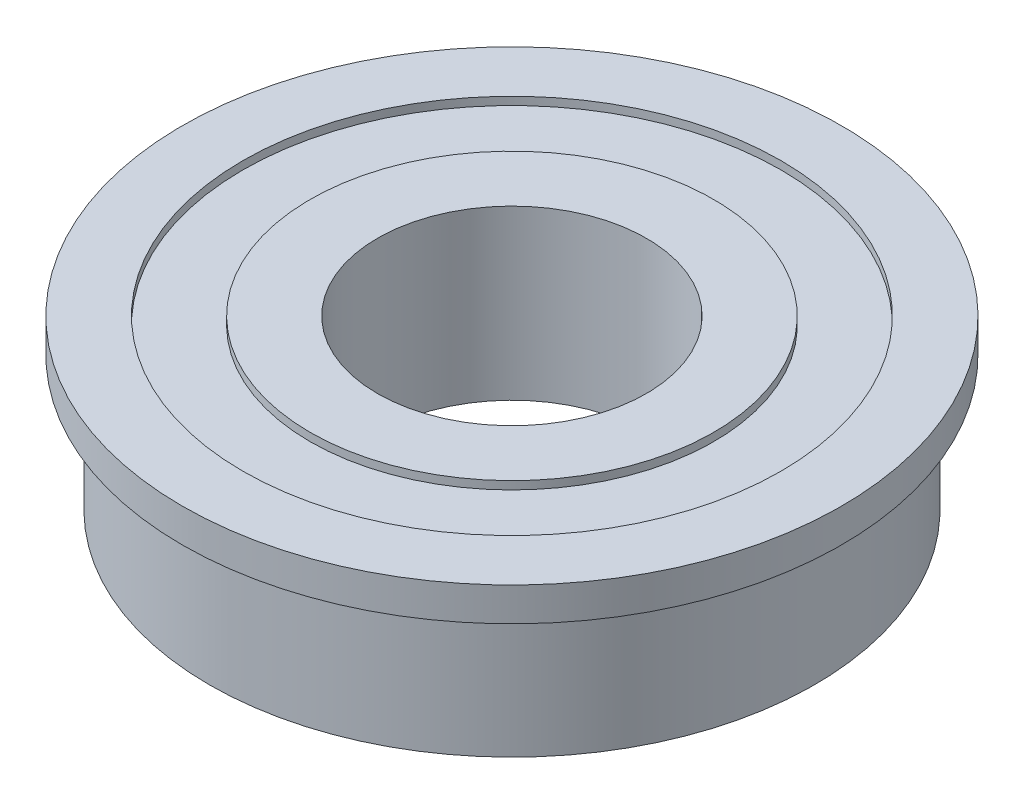
ISO-10303-21;
HEADER;
FILE_DESCRIPTION(('STEP AP214'),'2;1');
FILE_NAME('part.step','',(''),(''),'','','');
FILE_SCHEMA(('AUTOMOTIVE_DESIGN { 1 0 10303 214 1 1 1 1 }'));
ENDSEC;
DATA;
#1=APPLICATION_CONTEXT('core data for automotive mechanical design processes');
#2=APPLICATION_PROTOCOL_DEFINITION('international standard','automotive_design',2000,#1);
#3=PRODUCT_CONTEXT('',#1,'mechanical');
#4=PRODUCT('Part','Part','',(#3));
#5=PRODUCT_RELATED_PRODUCT_CATEGORY('part','',(#4));
#6=PRODUCT_DEFINITION_FORMATION('','',#4);
#7=PRODUCT_DEFINITION_CONTEXT('part definition',#1,'design');
#8=PRODUCT_DEFINITION('design','',#6,#7);
#9=PRODUCT_DEFINITION_SHAPE('','',#8);
#10=(LENGTH_UNIT() NAMED_UNIT(*) SI_UNIT(.MILLI.,.METRE.));
#11=(NAMED_UNIT(*) PLANE_ANGLE_UNIT() SI_UNIT($,.RADIAN.));
#12=(NAMED_UNIT(*) SI_UNIT($,.STERADIAN.) SOLID_ANGLE_UNIT());
#13=UNCERTAINTY_MEASURE_WITH_UNIT(LENGTH_MEASURE(1.E-05),#10,'distance_accuracy_value','');
#14=(GEOMETRIC_REPRESENTATION_CONTEXT(3) GLOBAL_UNCERTAINTY_ASSIGNED_CONTEXT((#13)) GLOBAL_UNIT_ASSIGNED_CONTEXT((#10,
#11,#12)) REPRESENTATION_CONTEXT('',''));
#15=CARTESIAN_POINT('',(0.,0.,0.));
#16=DIRECTION('',(0.,0.,1.));
#17=DIRECTION('',(1.,0.,0.));
#18=AXIS2_PLACEMENT_3D('',#15,#16,#17);
#19=CARTESIAN_POINT('',(0.,0.,0.));
#20=DIRECTION('',(0.,1.,0.));
#21=DIRECTION('',(0.,0.,1.));
#22=AXIS2_PLACEMENT_3D('',#19,#20,#21);
#23=CYLINDRICAL_SURFACE('',#22,15.5575);
#24=CARTESIAN_POINT('',(0.,6.34999999963,0.));
#25=DIRECTION('',(0.,1.,0.));
#26=DIRECTION('',(0.,0.,1.));
#27=AXIS2_PLACEMENT_3D('',#24,#25,#26);
#28=CIRCLE('',#27,15.5575);
#29=CARTESIAN_POINT('',(0.,6.34999999963,15.5575));
#30=VERTEX_POINT('',#29);
#31=EDGE_CURVE('E94',#30,#30,#28,.F.);
#32=ORIENTED_EDGE('',*,*,#31,.F.);
#33=EDGE_LOOP('',(#32));
#34=FACE_BOUND('',#33,.T.);
#35=CARTESIAN_POINT('',(0.,7.9375,0.));
#36=DIRECTION('',(0.,1.,0.));
#37=DIRECTION('',(0.,0.,1.));
#38=AXIS2_PLACEMENT_3D('',#35,#36,#37);
#39=CIRCLE('',#38,15.5575);
#40=CARTESIAN_POINT('',(0.,7.9375,15.5575));
#41=VERTEX_POINT('',#40);
#42=EDGE_CURVE('E51',#41,#41,#39,.T.);
#43=ORIENTED_EDGE('',*,*,#42,.F.);
#44=EDGE_LOOP('',(#43));
#45=FACE_BOUND('',#44,.T.);
#46=ADVANCED_FACE('F17',(#34,#45),#23,.T.);
#47=CARTESIAN_POINT('',(12.7,7.9375,0.));
#48=DIRECTION('',(0.,1.,0.));
#49=DIRECTION('',(0.,0.,1.));
#50=AXIS2_PLACEMENT_3D('',#47,#48,#49);
#51=PLANE('',#50);
#52=CARTESIAN_POINT('',(0.,7.9375,0.));
#53=DIRECTION('',(0.,1.,0.));
#54=DIRECTION('',(0.,0.,1.));
#55=AXIS2_PLACEMENT_3D('',#52,#53,#54);
#56=CIRCLE('',#55,12.7);
#57=CARTESIAN_POINT('',(0.,7.9375,12.7));
#58=VERTEX_POINT('',#57);
#59=EDGE_CURVE('E42',#58,#58,#56,.F.);
#60=ORIENTED_EDGE('',*,*,#59,.T.);
#61=EDGE_LOOP('',(#60));
#62=FACE_BOUND('',#61,.T.);
#63=ORIENTED_EDGE('',*,*,#42,.T.);
#64=EDGE_LOOP('',(#63));
#65=FACE_BOUND('',#64,.T.);
#66=ADVANCED_FACE('F100',(#62,#65),#51,.T.);
#67=CARTESIAN_POINT('',(15.5575,6.35,0.));
#68=DIRECTION('',(0.,-1.,0.));
#69=DIRECTION('',(0.,0.,-1.));
#70=AXIS2_PLACEMENT_3D('',#67,#68,#69);
#71=PLANE('',#70);
#72=CARTESIAN_POINT('',(0.,6.35,0.));
#73=DIRECTION('',(0.,-1.,0.));
#74=DIRECTION('',(0.,0.,-1.));
#75=AXIS2_PLACEMENT_3D('',#72,#73,#74);
#76=CIRCLE('',#75,14.2875);
#77=CARTESIAN_POINT('',(0.,6.35,14.2875));
#78=VERTEX_POINT('',#77);
#79=CARTESIAN_POINT('',(0.,6.35,-14.2875));
#80=VERTEX_POINT('',#79);
#81=EDGE_CURVE('E37',#78,#80,#76,.F.);
#82=ORIENTED_EDGE('',*,*,#81,.T.);
#83=CARTESIAN_POINT('',(0.,6.35,0.));
#84=DIRECTION('',(0.,-1.,0.));
#85=DIRECTION('',(0.,0.,1.));
#86=AXIS2_PLACEMENT_3D('',#83,#84,#85);
#87=CIRCLE('',#86,14.2875);
#88=EDGE_CURVE('E34',#80,#78,#87,.F.);
#89=ORIENTED_EDGE('',*,*,#88,.T.);
#90=EDGE_LOOP('',(#82,#89));
#91=FACE_BOUND('',#90,.T.);
#92=ORIENTED_EDGE('',*,*,#31,.T.);
#93=EDGE_LOOP('',(#92));
#94=FACE_BOUND('',#93,.T.);
#95=ADVANCED_FACE('F39',(#91,#94),#71,.T.);
#96=CARTESIAN_POINT('',(0.,0.,0.));
#97=DIRECTION('',(0.,1.,0.));
#98=DIRECTION('',(0.,0.,1.));
#99=AXIS2_PLACEMENT_3D('',#96,#97,#98);
#100=CYLINDRICAL_SURFACE('',#99,12.7);
#101=ORIENTED_EDGE('',*,*,#59,.F.);
#102=EDGE_LOOP('',(#101));
#103=FACE_BOUND('',#102,.T.);
#104=CARTESIAN_POINT('',(0.,7.55650000088,0.));
#105=DIRECTION('',(0.,1.,0.));
#106=DIRECTION('',(0.,0.,1.));
#107=AXIS2_PLACEMENT_3D('',#104,#105,#106);
#108=CIRCLE('',#107,12.7);
#109=CARTESIAN_POINT('',(0.,7.55650000088,12.7));
#110=VERTEX_POINT('',#109);
#111=EDGE_CURVE('E48',#110,#110,#108,.T.);
#112=ORIENTED_EDGE('',*,*,#111,.F.);
#113=EDGE_LOOP('',(#112));
#114=FACE_BOUND('',#113,.T.);
#115=ADVANCED_FACE('F144',(#103,#114),#100,.F.);
#116=CARTESIAN_POINT('',(9.525,7.5565,0.));
#117=DIRECTION('',(0.,1.,0.));
#118=DIRECTION('',(0.,0.,1.));
#119=AXIS2_PLACEMENT_3D('',#116,#117,#118);
#120=PLANE('',#119);
#121=CARTESIAN_POINT('',(0.,7.55650000088,0.));
#122=DIRECTION('',(0.,1.,0.));
#123=DIRECTION('',(0.,0.,1.));
#124=AXIS2_PLACEMENT_3D('',#121,#122,#123);
#125=CIRCLE('',#124,9.525);
#126=CARTESIAN_POINT('',(0.,7.55650000088,9.525));
#127=VERTEX_POINT('',#126);
#128=EDGE_CURVE('E75',#127,#127,#125,.T.);
#129=ORIENTED_EDGE('',*,*,#128,.F.);
#130=EDGE_LOOP('',(#129));
#131=FACE_BOUND('',#130,.T.);
#132=ORIENTED_EDGE('',*,*,#111,.T.);
#133=EDGE_LOOP('',(#132));
#134=FACE_BOUND('',#133,.T.);
#135=ADVANCED_FACE('F65',(#131,#134),#120,.T.);
#136=CARTESIAN_POINT('',(0.,6.1,0.));
#137=DIRECTION('',(0.,1.,0.));
#138=DIRECTION('',(0.,0.,-1.));
#139=AXIS2_PLACEMENT_3D('',#136,#137,#138);
#140=TOROIDAL_SURFACE('',#139,14.2875,0.25);
#141=ORIENTED_EDGE('',*,*,#88,.F.);
#142=ORIENTED_EDGE('',*,*,#81,.F.);
#143=EDGE_LOOP('',(#141,#142));
#144=FACE_BOUND('',#143,.T.);
#145=CARTESIAN_POINT('',(0.,5.975,0.));
#146=DIRECTION('',(0.,-1.,0.));
#147=DIRECTION('',(0.,0.,1.));
#148=AXIS2_PLACEMENT_3D('',#145,#146,#147);
#149=CIRCLE('',#148,14.0709936491);
#150=CARTESIAN_POINT('',(0.,5.975,14.0709936491));
#151=VERTEX_POINT('',#150);
#152=EDGE_CURVE('E71',#151,#151,#149,.T.);
#153=ORIENTED_EDGE('',*,*,#152,.F.);
#154=EDGE_LOOP('',(#153));
#155=FACE_BOUND('',#154,.T.);
#156=ADVANCED_FACE('F46',(#144,#155),#140,.F.);
#157=CARTESIAN_POINT('',(0.,0.,0.));
#158=DIRECTION('',(0.,1.,0.));
#159=DIRECTION('',(0.,0.,1.));
#160=AXIS2_PLACEMENT_3D('',#157,#158,#159);
#161=CYLINDRICAL_SURFACE('',#160,9.525);
#162=ORIENTED_EDGE('',*,*,#128,.T.);
#163=EDGE_LOOP('',(#162));
#164=FACE_BOUND('',#163,.T.);
#165=CARTESIAN_POINT('',(0.,7.9375,0.));
#166=DIRECTION('',(0.,1.,0.));
#167=DIRECTION('',(0.,0.,1.));
#168=AXIS2_PLACEMENT_3D('',#165,#166,#167);
#169=CIRCLE('',#168,9.525);
#170=CARTESIAN_POINT('',(0.,7.9375,9.525));
#171=VERTEX_POINT('',#170);
#172=EDGE_CURVE('E74',#171,#171,#169,.T.);
#173=ORIENTED_EDGE('',*,*,#172,.F.);
#174=EDGE_LOOP('',(#173));
#175=FACE_BOUND('',#174,.T.);
#176=ADVANCED_FACE('F64',(#164,#175),#161,.T.);
#177=CARTESIAN_POINT('',(0.,5.5999999997424,0.));
#178=DIRECTION('',(0.,-1.,0.));
#179=DIRECTION('',(0.,0.,-1.));
#180=AXIS2_PLACEMENT_3D('',#177,#178,#179);
#181=CONICAL_SURFACE('',#180,14.2875000001947,0.523598775597999);
#182=ORIENTED_EDGE('',*,*,#152,.T.);
#183=EDGE_LOOP('',(#182));
#184=FACE_BOUND('',#183,.T.);
#185=CARTESIAN_POINT('',(0.,5.59999999963,0.));
#186=DIRECTION('',(0.,1.,0.));
#187=DIRECTION('',(0.,0.,1.));
#188=AXIS2_PLACEMENT_3D('',#185,#186,#187);
#189=CIRCLE('',#188,14.2875);
#190=CARTESIAN_POINT('',(0.,5.59999999963,14.2875));
#191=VERTEX_POINT('',#190);
#192=EDGE_CURVE('E76',#191,#191,#189,.F.);
#193=ORIENTED_EDGE('',*,*,#192,.F.);
#194=EDGE_LOOP('',(#193));
#195=FACE_BOUND('',#194,.T.);
#196=ADVANCED_FACE('F127',(#184,#195),#181,.T.);
#197=CARTESIAN_POINT('',(6.35,7.9375,0.));
#198=DIRECTION('',(0.,1.,0.));
#199=DIRECTION('',(0.,0.,1.));
#200=AXIS2_PLACEMENT_3D('',#197,#198,#199);
#201=PLANE('',#200);
#202=CARTESIAN_POINT('',(0.,7.9375,0.));
#203=DIRECTION('',(0.,1.,0.));
#204=DIRECTION('',(0.,0.,1.));
#205=AXIS2_PLACEMENT_3D('',#202,#203,#204);
#206=CIRCLE('',#205,6.35);
#207=CARTESIAN_POINT('',(0.,7.9375,6.35));
#208=VERTEX_POINT('',#207);
#209=EDGE_CURVE('E78',#208,#208,#206,.F.);
#210=ORIENTED_EDGE('',*,*,#209,.T.);
#211=EDGE_LOOP('',(#210));
#212=FACE_BOUND('',#211,.T.);
#213=ORIENTED_EDGE('',*,*,#172,.T.);
#214=EDGE_LOOP('',(#213));
#215=FACE_BOUND('',#214,.T.);
#216=ADVANCED_FACE('F124',(#212,#215),#201,.T.);
#217=CARTESIAN_POINT('',(0.,0.,0.));
#218=DIRECTION('',(0.,1.,0.));
#219=DIRECTION('',(0.,0.,1.));
#220=AXIS2_PLACEMENT_3D('',#217,#218,#219);
#221=CYLINDRICAL_SURFACE('',#220,14.2875);
#222=CARTESIAN_POINT('',(0.,0.,0.));
#223=DIRECTION('',(0.,1.,0.));
#224=DIRECTION('',(0.,0.,1.));
#225=AXIS2_PLACEMENT_3D('',#222,#223,#224);
#226=CIRCLE('',#225,14.2875);
#227=CARTESIAN_POINT('',(0.,0.,14.2875));
#228=VERTEX_POINT('',#227);
#229=EDGE_CURVE('E27',#228,#228,#226,.F.);
#230=ORIENTED_EDGE('',*,*,#229,.F.);
#231=EDGE_LOOP('',(#230));
#232=FACE_BOUND('',#231,.T.);
#233=ORIENTED_EDGE('',*,*,#192,.T.);
#234=EDGE_LOOP('',(#233));
#235=FACE_BOUND('',#234,.T.);
#236=ADVANCED_FACE('F117',(#232,#235),#221,.T.);
#237=CARTESIAN_POINT('',(0.,0.,0.));
#238=DIRECTION('',(0.,1.,0.));
#239=DIRECTION('',(0.,0.,1.));
#240=AXIS2_PLACEMENT_3D('',#237,#238,#239);
#241=CYLINDRICAL_SURFACE('',#240,6.35);
#242=ORIENTED_EDGE('',*,*,#209,.F.);
#243=EDGE_LOOP('',(#242));
#244=FACE_BOUND('',#243,.T.);
#245=CARTESIAN_POINT('',(0.,0.,0.));
#246=DIRECTION('',(0.,1.,0.));
#247=DIRECTION('',(0.,0.,1.));
#248=AXIS2_PLACEMENT_3D('',#245,#246,#247);
#249=CIRCLE('',#248,6.35);
#250=CARTESIAN_POINT('',(0.,0.,6.35));
#251=VERTEX_POINT('',#250);
#252=EDGE_CURVE('E11',#251,#251,#249,.T.);
#253=ORIENTED_EDGE('',*,*,#252,.F.);
#254=EDGE_LOOP('',(#253));
#255=FACE_BOUND('',#254,.T.);
#256=ADVANCED_FACE('F111',(#244,#255),#241,.F.);
#257=CARTESIAN_POINT('',(14.2875,0.,0.));
#258=DIRECTION('',(0.,-1.,0.));
#259=DIRECTION('',(0.,0.,-1.));
#260=AXIS2_PLACEMENT_3D('',#257,#258,#259);
#261=PLANE('',#260);
#262=ORIENTED_EDGE('',*,*,#252,.T.);
#263=EDGE_LOOP('',(#262));
#264=FACE_BOUND('',#263,.T.);
#265=ORIENTED_EDGE('',*,*,#229,.T.);
#266=EDGE_LOOP('',(#265));
#267=FACE_BOUND('',#266,.T.);
#268=ADVANCED_FACE('F109',(#264,#267),#261,.T.);
#269=CLOSED_SHELL('',(#46,#66,#95,#115,#135,#156,#176,#196,#216,#236,#256,#268));
#270=MANIFOLD_SOLID_BREP('B1',#269);
#271=ADVANCED_BREP_SHAPE_REPRESENTATION('',(#18,#270),#14);
#272=SHAPE_DEFINITION_REPRESENTATION(#9,#271);
ENDSEC;
END-ISO-10303-21;
